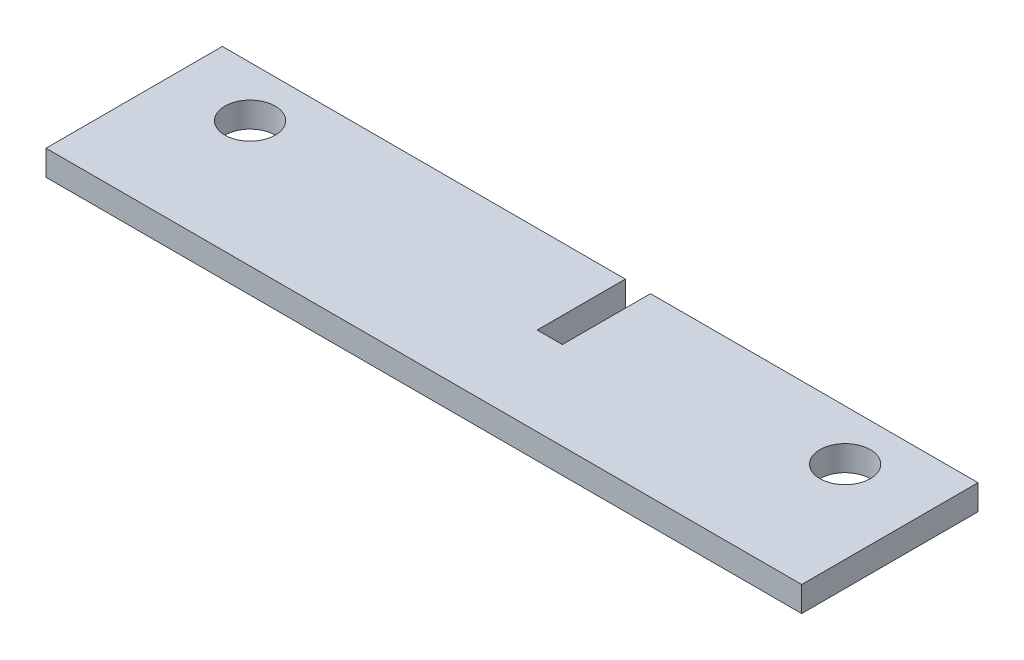
ISO-10303-21;
HEADER;
FILE_DESCRIPTION(('STEP AP214'),'2;1');
FILE_NAME('part.step','',(''),(''),'','','');
FILE_SCHEMA(('AUTOMOTIVE_DESIGN { 1 0 10303 214 1 1 1 1 }'));
ENDSEC;
DATA;
#1=APPLICATION_CONTEXT('core data for automotive mechanical design processes');
#2=APPLICATION_PROTOCOL_DEFINITION('international standard','automotive_design',2000,#1);
#3=PRODUCT_CONTEXT('',#1,'mechanical');
#4=PRODUCT('Part','Part','',(#3));
#5=PRODUCT_RELATED_PRODUCT_CATEGORY('part','',(#4));
#6=PRODUCT_DEFINITION_FORMATION('','',#4);
#7=PRODUCT_DEFINITION_CONTEXT('part definition',#1,'design');
#8=PRODUCT_DEFINITION('design','',#6,#7);
#9=PRODUCT_DEFINITION_SHAPE('','',#8);
#10=(LENGTH_UNIT() NAMED_UNIT(*) SI_UNIT(.MILLI.,.METRE.));
#11=(NAMED_UNIT(*) PLANE_ANGLE_UNIT() SI_UNIT($,.RADIAN.));
#12=(NAMED_UNIT(*) SI_UNIT($,.STERADIAN.) SOLID_ANGLE_UNIT());
#13=UNCERTAINTY_MEASURE_WITH_UNIT(LENGTH_MEASURE(1.E-05),#10,'distance_accuracy_value','');
#14=(GEOMETRIC_REPRESENTATION_CONTEXT(3) GLOBAL_UNCERTAINTY_ASSIGNED_CONTEXT((#13)) GLOBAL_UNIT_ASSIGNED_CONTEXT((#10,
#11,#12)) REPRESENTATION_CONTEXT('',''));
#15=CARTESIAN_POINT('',(0.,0.,0.));
#16=DIRECTION('',(0.,0.,1.));
#17=DIRECTION('',(1.,0.,0.));
#18=AXIS2_PLACEMENT_3D('',#15,#16,#17);
#19=CARTESIAN_POINT('',(0.,0.,249.6));
#20=DIRECTION('',(0.,0.,1.));
#21=DIRECTION('',(1.,0.,0.));
#22=AXIS2_PLACEMENT_3D('',#19,#20,#21);
#23=PLANE('',#22);
#24=DIRECTION('',(-1.,0.,0.));
#25=VECTOR('',#24,1.);
#26=CARTESIAN_POINT('',(2260.6,65.,249.6));
#27=LINE('',#26,#25);
#28=CARTESIAN_POINT('',(2463.8,65.,249.6));
#29=VERTEX_POINT('',#28);
#30=CARTESIAN_POINT('',(2260.6,65.,249.6));
#31=VERTEX_POINT('',#30);
#32=EDGE_CURVE('E159',#29,#31,#27,.T.);
#33=ORIENTED_EDGE('',*,*,#32,.F.);
#34=DIRECTION('',(0.,1.,0.));
#35=VECTOR('',#34,1.);
#36=CARTESIAN_POINT('',(2463.8,52.3,249.6));
#37=LINE('',#36,#35);
#38=CARTESIAN_POINT('',(2463.8,52.3,249.6));
#39=VERTEX_POINT('',#38);
#40=EDGE_CURVE('E140',#39,#29,#37,.T.);
#41=ORIENTED_EDGE('',*,*,#40,.F.);
#42=DIRECTION('',(1.,0.,0.));
#43=VECTOR('',#42,1.);
#44=CARTESIAN_POINT('',(2260.6,52.3,249.6));
#45=LINE('',#44,#43);
#46=CARTESIAN_POINT('',(2260.6,52.3,249.6));
#47=VERTEX_POINT('',#46);
#48=EDGE_CURVE('E134',#47,#39,#45,.T.);
#49=ORIENTED_EDGE('',*,*,#48,.F.);
#50=DIRECTION('',(0.,-1.,0.));
#51=VECTOR('',#50,1.);
#52=CARTESIAN_POINT('',(2260.6,65.,249.6));
#53=LINE('',#52,#51);
#54=EDGE_CURVE('E113',#31,#47,#53,.T.);
#55=ORIENTED_EDGE('',*,*,#54,.F.);
#56=EDGE_LOOP('',(#33,#41,#49,#55));
#57=FACE_BOUND('',#56,.T.);
#58=ADVANCED_FACE('F37',(#57),#23,.F.);
#59=CARTESIAN_POINT('',(2260.6,65.,249.6));
#60=DIRECTION('',(-1.,0.,0.));
#61=DIRECTION('',(0.,0.,1.));
#62=AXIS2_PLACEMENT_3D('',#59,#60,#61);
#63=PLANE('',#62);
#64=DIRECTION('',(0.,0.,1.));
#65=VECTOR('',#64,1.);
#66=CARTESIAN_POINT('',(2260.6,52.3,249.6));
#67=LINE('',#66,#65);
#68=CARTESIAN_POINT('',(2260.6,52.3,338.5));
#69=VERTEX_POINT('',#68);
#70=EDGE_CURVE('E106',#47,#69,#67,.T.);
#71=ORIENTED_EDGE('',*,*,#70,.T.);
#72=DIRECTION('',(0.,-1.,0.));
#73=VECTOR('',#72,1.);
#74=CARTESIAN_POINT('',(2260.6,65.,338.5));
#75=LINE('',#74,#73);
#76=CARTESIAN_POINT('',(2260.6,65.,338.5));
#77=VERTEX_POINT('',#76);
#78=EDGE_CURVE('E111',#77,#69,#75,.T.);
#79=ORIENTED_EDGE('',*,*,#78,.F.);
#80=DIRECTION('',(0.,0.,1.));
#81=VECTOR('',#80,1.);
#82=CARTESIAN_POINT('',(2260.6,65.,249.6));
#83=LINE('',#82,#81);
#84=EDGE_CURVE('E170',#31,#77,#83,.T.);
#85=ORIENTED_EDGE('',*,*,#84,.F.);
#86=ORIENTED_EDGE('',*,*,#54,.T.);
#87=EDGE_LOOP('',(#71,#79,#85,#86));
#88=FACE_BOUND('',#87,.T.);
#89=ADVANCED_FACE('F108',(#88),#63,.T.);
#90=CARTESIAN_POINT('',(2260.6,65.,249.6));
#91=DIRECTION('',(0.,1.,0.));
#92=DIRECTION('',(0.,0.,1.));
#93=AXIS2_PLACEMENT_3D('',#90,#91,#92);
#94=PLANE('',#93);
#95=CARTESIAN_POINT('',(2599.99999999996,65.,275.));
#96=DIRECTION('',(0.,1.,0.));
#97=DIRECTION('',(0.,0.,1.));
#98=AXIS2_PLACEMENT_3D('',#95,#96,#97);
#99=CIRCLE('',#98,12.6999999999999);
#100=CARTESIAN_POINT('',(2599.99999999996,64.9999999999999,262.3));
#101=VERTEX_POINT('',#100);
#102=EDGE_CURVE('E154',#101,#101,#99,.F.);
#103=ORIENTED_EDGE('',*,*,#102,.T.);
#104=EDGE_LOOP('',(#103));
#105=FACE_BOUND('',#104,.T.);
#106=CARTESIAN_POINT('',(2299.99999999996,65.,275.));
#107=DIRECTION('',(0.,1.,0.));
#108=DIRECTION('',(0.,0.,1.));
#109=AXIS2_PLACEMENT_3D('',#106,#107,#108);
#110=CIRCLE('',#109,12.6999999999999);
#111=CARTESIAN_POINT('',(2299.99999999996,65.,262.3));
#112=VERTEX_POINT('',#111);
#113=EDGE_CURVE('E41',#112,#112,#110,.F.);
#114=ORIENTED_EDGE('',*,*,#113,.T.);
#115=EDGE_LOOP('',(#114));
#116=FACE_BOUND('',#115,.T.);
#117=DIRECTION('',(0.,0.,1.));
#118=VECTOR('',#117,1.);
#119=CARTESIAN_POINT('',(2463.8,65.,249.6));
#120=LINE('',#119,#118);
#121=CARTESIAN_POINT('',(2463.8,65.,294.05));
#122=VERTEX_POINT('',#121);
#123=EDGE_CURVE('E142',#29,#122,#120,.T.);
#124=ORIENTED_EDGE('',*,*,#123,.F.);
#125=ORIENTED_EDGE('',*,*,#32,.T.);
#126=ORIENTED_EDGE('',*,*,#84,.T.);
#127=DIRECTION('',(-1.,0.,0.));
#128=VECTOR('',#127,1.);
#129=CARTESIAN_POINT('',(2260.6,65.,338.5));
#130=LINE('',#129,#128);
#131=CARTESIAN_POINT('',(2641.6,65.,338.5));
#132=VERTEX_POINT('',#131);
#133=EDGE_CURVE('E132',#132,#77,#130,.T.);
#134=ORIENTED_EDGE('',*,*,#133,.F.);
#135=DIRECTION('',(0.,0.,1.));
#136=VECTOR('',#135,1.);
#137=CARTESIAN_POINT('',(2641.6,65.,249.6));
#138=LINE('',#137,#136);
#139=CARTESIAN_POINT('',(2641.6,65.,249.6));
#140=VERTEX_POINT('',#139);
#141=EDGE_CURVE('E168',#140,#132,#138,.T.);
#142=ORIENTED_EDGE('',*,*,#141,.F.);
#143=CARTESIAN_POINT('',(2476.5,65.,249.6));
#144=VERTEX_POINT('',#143);
#145=EDGE_CURVE('E172',#140,#144,#27,.T.);
#146=ORIENTED_EDGE('',*,*,#145,.T.);
#147=DIRECTION('',(0.,0.,-1.));
#148=VECTOR('',#147,1.);
#149=CARTESIAN_POINT('',(2476.5,65.,249.6));
#150=LINE('',#149,#148);
#151=CARTESIAN_POINT('',(2476.5,65.,294.05));
#152=VERTEX_POINT('',#151);
#153=EDGE_CURVE('E77',#152,#144,#150,.T.);
#154=ORIENTED_EDGE('',*,*,#153,.F.);
#155=DIRECTION('',(1.,0.,0.));
#156=VECTOR('',#155,1.);
#157=CARTESIAN_POINT('',(2463.8,65.,294.05));
#158=LINE('',#157,#156);
#159=EDGE_CURVE('E47',#122,#152,#158,.T.);
#160=ORIENTED_EDGE('',*,*,#159,.F.);
#161=EDGE_LOOP('',(#124,#125,#126,#134,#142,#146,#154,#160));
#162=FACE_BOUND('',#161,.T.);
#163=ADVANCED_FACE('F39',(#105,#116,#162),#94,.T.);
#164=CARTESIAN_POINT('',(2641.6,65.,249.6));
#165=DIRECTION('',(1.,0.,0.));
#166=DIRECTION('',(0.,0.,-1.));
#167=AXIS2_PLACEMENT_3D('',#164,#165,#166);
#168=PLANE('',#167);
#169=ORIENTED_EDGE('',*,*,#141,.T.);
#170=DIRECTION('',(0.,1.,0.));
#171=VECTOR('',#170,1.);
#172=CARTESIAN_POINT('',(2641.6,65.,338.5));
#173=LINE('',#172,#171);
#174=CARTESIAN_POINT('',(2641.6,52.3,338.5));
#175=VERTEX_POINT('',#174);
#176=EDGE_CURVE('E127',#175,#132,#173,.T.);
#177=ORIENTED_EDGE('',*,*,#176,.F.);
#178=DIRECTION('',(0.,0.,1.));
#179=VECTOR('',#178,1.);
#180=CARTESIAN_POINT('',(2641.6,52.3,249.6));
#181=LINE('',#180,#179);
#182=CARTESIAN_POINT('',(2641.6,52.3,249.6));
#183=VERTEX_POINT('',#182);
#184=EDGE_CURVE('E123',#183,#175,#181,.T.);
#185=ORIENTED_EDGE('',*,*,#184,.F.);
#186=DIRECTION('',(0.,1.,0.));
#187=VECTOR('',#186,1.);
#188=CARTESIAN_POINT('',(2641.6,65.,249.6));
#189=LINE('',#188,#187);
#190=EDGE_CURVE('E177',#183,#140,#189,.T.);
#191=ORIENTED_EDGE('',*,*,#190,.T.);
#192=EDGE_LOOP('',(#169,#177,#185,#191));
#193=FACE_BOUND('',#192,.T.);
#194=ADVANCED_FACE('F183',(#193),#168,.T.);
#195=CARTESIAN_POINT('',(2260.6,52.3,249.6));
#196=DIRECTION('',(0.,-1.,0.));
#197=DIRECTION('',(0.,0.,-1.));
#198=AXIS2_PLACEMENT_3D('',#195,#196,#197);
#199=PLANE('',#198);
#200=CARTESIAN_POINT('',(2599.99999999996,52.3,275.));
#201=DIRECTION('',(0.,-1.,0.));
#202=DIRECTION('',(0.,0.,-1.));
#203=AXIS2_PLACEMENT_3D('',#200,#201,#202);
#204=CIRCLE('',#203,12.6999999999999);
#205=CARTESIAN_POINT('',(2599.99999999996,52.3,262.3));
#206=VERTEX_POINT('',#205);
#207=EDGE_CURVE('E178',#206,#206,#204,.F.);
#208=ORIENTED_EDGE('',*,*,#207,.T.);
#209=EDGE_LOOP('',(#208));
#210=FACE_BOUND('',#209,.T.);
#211=CARTESIAN_POINT('',(2299.99999999996,52.3,275.));
#212=DIRECTION('',(0.,-1.,0.));
#213=DIRECTION('',(0.,0.,-1.));
#214=AXIS2_PLACEMENT_3D('',#211,#212,#213);
#215=CIRCLE('',#214,12.6999999999999);
#216=CARTESIAN_POINT('',(2299.99999999996,52.3,262.3));
#217=VERTEX_POINT('',#216);
#218=EDGE_CURVE('E153',#217,#217,#215,.F.);
#219=ORIENTED_EDGE('',*,*,#218,.T.);
#220=EDGE_LOOP('',(#219));
#221=FACE_BOUND('',#220,.T.);
#222=DIRECTION('',(0.,0.,1.));
#223=VECTOR('',#222,1.);
#224=CARTESIAN_POINT('',(2463.8,52.3,249.6));
#225=LINE('',#224,#223);
#226=CARTESIAN_POINT('',(2463.8,52.3,294.05));
#227=VERTEX_POINT('',#226);
#228=EDGE_CURVE('E152',#39,#227,#225,.T.);
#229=ORIENTED_EDGE('',*,*,#228,.T.);
#230=DIRECTION('',(1.,0.,0.));
#231=VECTOR('',#230,1.);
#232=CARTESIAN_POINT('',(2463.8,52.3,294.05));
#233=LINE('',#232,#231);
#234=CARTESIAN_POINT('',(2476.5,52.3,294.05));
#235=VERTEX_POINT('',#234);
#236=EDGE_CURVE('E149',#227,#235,#233,.T.);
#237=ORIENTED_EDGE('',*,*,#236,.T.);
#238=DIRECTION('',(0.,0.,-1.));
#239=VECTOR('',#238,1.);
#240=CARTESIAN_POINT('',(2476.5,52.3,249.6));
#241=LINE('',#240,#239);
#242=CARTESIAN_POINT('',(2476.5,52.3,249.6));
#243=VERTEX_POINT('',#242);
#244=EDGE_CURVE('E146',#235,#243,#241,.T.);
#245=ORIENTED_EDGE('',*,*,#244,.T.);
#246=EDGE_CURVE('E148',#243,#183,#45,.T.);
#247=ORIENTED_EDGE('',*,*,#246,.T.);
#248=ORIENTED_EDGE('',*,*,#184,.T.);
#249=DIRECTION('',(1.,0.,0.));
#250=VECTOR('',#249,1.);
#251=CARTESIAN_POINT('',(2260.6,52.3,338.5));
#252=LINE('',#251,#250);
#253=EDGE_CURVE('E119',#69,#175,#252,.T.);
#254=ORIENTED_EDGE('',*,*,#253,.F.);
#255=ORIENTED_EDGE('',*,*,#70,.F.);
#256=ORIENTED_EDGE('',*,*,#48,.T.);
#257=EDGE_LOOP('',(#229,#237,#245,#247,#248,#254,#255,#256));
#258=FACE_BOUND('',#257,.T.);
#259=ADVANCED_FACE('F121',(#210,#221,#258),#199,.T.);
#260=ORIENTED_EDGE('',*,*,#246,.F.);
#261=DIRECTION('',(0.,1.,0.));
#262=VECTOR('',#261,1.);
#263=CARTESIAN_POINT('',(2476.5,52.3,249.6));
#264=LINE('',#263,#262);
#265=EDGE_CURVE('E72',#243,#144,#264,.T.);
#266=ORIENTED_EDGE('',*,*,#265,.T.);
#267=ORIENTED_EDGE('',*,*,#145,.F.);
#268=ORIENTED_EDGE('',*,*,#190,.F.);
#269=EDGE_LOOP('',(#260,#266,#267,#268));
#270=FACE_BOUND('',#269,.T.);
#271=ADVANCED_FACE('F190',(#270),#23,.F.);
#272=CARTESIAN_POINT('',(0.,0.,338.5));
#273=DIRECTION('',(0.,0.,1.));
#274=DIRECTION('',(1.,0.,0.));
#275=AXIS2_PLACEMENT_3D('',#272,#273,#274);
#276=PLANE('',#275);
#277=ORIENTED_EDGE('',*,*,#78,.T.);
#278=ORIENTED_EDGE('',*,*,#253,.T.);
#279=ORIENTED_EDGE('',*,*,#176,.T.);
#280=ORIENTED_EDGE('',*,*,#133,.T.);
#281=EDGE_LOOP('',(#277,#278,#279,#280));
#282=FACE_BOUND('',#281,.T.);
#283=ADVANCED_FACE('F130',(#282),#276,.T.);
#284=CARTESIAN_POINT('',(2463.8,52.3,249.6));
#285=DIRECTION('',(-1.,0.,0.));
#286=DIRECTION('',(0.,0.,1.));
#287=AXIS2_PLACEMENT_3D('',#284,#285,#286);
#288=PLANE('',#287);
#289=ORIENTED_EDGE('',*,*,#123,.T.);
#290=DIRECTION('',(0.,1.,0.));
#291=VECTOR('',#290,1.);
#292=CARTESIAN_POINT('',(2463.8,52.3,294.05));
#293=LINE('',#292,#291);
#294=EDGE_CURVE('E11',#227,#122,#293,.T.);
#295=ORIENTED_EDGE('',*,*,#294,.F.);
#296=ORIENTED_EDGE('',*,*,#228,.F.);
#297=ORIENTED_EDGE('',*,*,#40,.T.);
#298=EDGE_LOOP('',(#289,#295,#296,#297));
#299=FACE_BOUND('',#298,.T.);
#300=ADVANCED_FACE('F205',(#299),#288,.F.);
#301=CARTESIAN_POINT('',(2476.5,52.3,249.6));
#302=DIRECTION('',(1.,0.,0.));
#303=DIRECTION('',(0.,0.,-1.));
#304=AXIS2_PLACEMENT_3D('',#301,#302,#303);
#305=PLANE('',#304);
#306=ORIENTED_EDGE('',*,*,#153,.T.);
#307=ORIENTED_EDGE('',*,*,#265,.F.);
#308=ORIENTED_EDGE('',*,*,#244,.F.);
#309=DIRECTION('',(0.,1.,0.));
#310=VECTOR('',#309,1.);
#311=CARTESIAN_POINT('',(2476.5,52.3,294.05));
#312=LINE('',#311,#310);
#313=EDGE_CURVE('E138',#235,#152,#312,.T.);
#314=ORIENTED_EDGE('',*,*,#313,.T.);
#315=EDGE_LOOP('',(#306,#307,#308,#314));
#316=FACE_BOUND('',#315,.T.);
#317=ADVANCED_FACE('F211',(#316),#305,.F.);
#318=CARTESIAN_POINT('',(2463.8,52.3,294.05));
#319=DIRECTION('',(0.,0.,1.));
#320=DIRECTION('',(1.,0.,0.));
#321=AXIS2_PLACEMENT_3D('',#318,#319,#320);
#322=PLANE('',#321);
#323=ORIENTED_EDGE('',*,*,#159,.T.);
#324=ORIENTED_EDGE('',*,*,#313,.F.);
#325=ORIENTED_EDGE('',*,*,#236,.F.);
#326=ORIENTED_EDGE('',*,*,#294,.T.);
#327=EDGE_LOOP('',(#323,#324,#325,#326));
#328=FACE_BOUND('',#327,.T.);
#329=ADVANCED_FACE('F210',(#328),#322,.F.);
#330=CARTESIAN_POINT('',(2299.99999999996,181.249999999996,275.));
#331=DIRECTION('',(0.,-1.,0.));
#332=DIRECTION('',(0.,0.,-1.));
#333=AXIS2_PLACEMENT_3D('',#330,#331,#332);
#334=CYLINDRICAL_SURFACE('',#333,12.6999999999999);
#335=CARTESIAN_POINT('',(2299.99999999996,65.,262.3));
#336=CARTESIAN_POINT('',(2299.99999999996,64.8677083333333,262.3));
#337=CARTESIAN_POINT('',(2299.99999999996,64.7354166666666,262.3));
#338=CARTESIAN_POINT('',(2299.99999999996,64.4708333333333,262.3));
#339=CARTESIAN_POINT('',(2299.99999999996,64.3385416666666,262.3));
#340=CARTESIAN_POINT('',(2299.99999999996,64.0739583333333,262.3));
#341=CARTESIAN_POINT('',(2299.99999999996,63.9416666666666,262.3));
#342=CARTESIAN_POINT('',(2299.99999999996,63.6770833333333,262.3));
#343=CARTESIAN_POINT('',(2299.99999999996,63.5447916666666,262.3));
#344=CARTESIAN_POINT('',(2299.99999999996,63.2802083333333,262.3));
#345=CARTESIAN_POINT('',(2299.99999999996,63.1479166666666,262.3));
#346=CARTESIAN_POINT('',(2299.99999999996,62.8833333333333,262.3));
#347=CARTESIAN_POINT('',(2299.99999999996,62.7510416666666,262.3));
#348=CARTESIAN_POINT('',(2299.99999999996,62.4864583333333,262.3));
#349=CARTESIAN_POINT('',(2299.99999999996,62.3541666666666,262.3));
#350=CARTESIAN_POINT('',(2299.99999999996,62.0895833333333,262.3));
#351=CARTESIAN_POINT('',(2299.99999999996,61.9572916666666,262.3));
#352=CARTESIAN_POINT('',(2299.99999999996,61.6927083333333,262.3));
#353=CARTESIAN_POINT('',(2299.99999999996,61.5604166666666,262.3));
#354=CARTESIAN_POINT('',(2299.99999999996,61.2958333333333,262.3));
#355=CARTESIAN_POINT('',(2299.99999999996,61.1635416666666,262.3));
#356=CARTESIAN_POINT('',(2299.99999999996,60.8989583333333,262.3));
#357=CARTESIAN_POINT('',(2299.99999999996,60.7666666666666,262.3));
#358=CARTESIAN_POINT('',(2299.99999999996,60.5020833333333,262.3));
#359=CARTESIAN_POINT('',(2299.99999999996,60.3697916666666,262.3));
#360=CARTESIAN_POINT('',(2299.99999999996,60.1052083333333,262.3));
#361=CARTESIAN_POINT('',(2299.99999999996,59.9729166666666,262.3));
#362=CARTESIAN_POINT('',(2299.99999999996,59.7083333333333,262.3));
#363=CARTESIAN_POINT('',(2299.99999999996,59.5760416666666,262.3));
#364=CARTESIAN_POINT('',(2299.99999999996,59.3114583333333,262.3));
#365=CARTESIAN_POINT('',(2299.99999999996,59.1791666666666,262.3));
#366=CARTESIAN_POINT('',(2299.99999999996,58.9145833333333,262.3));
#367=CARTESIAN_POINT('',(2299.99999999996,58.7822916666666,262.3));
#368=CARTESIAN_POINT('',(2299.99999999996,58.5177083333333,262.3));
#369=CARTESIAN_POINT('',(2299.99999999996,58.3854166666666,262.3));
#370=CARTESIAN_POINT('',(2299.99999999996,58.1208333333333,262.3));
#371=CARTESIAN_POINT('',(2299.99999999996,57.9885416666666,262.3));
#372=CARTESIAN_POINT('',(2299.99999999996,57.7239583333333,262.3));
#373=CARTESIAN_POINT('',(2299.99999999996,57.5916666666666,262.3));
#374=CARTESIAN_POINT('',(2299.99999999996,57.3270833333333,262.3));
#375=CARTESIAN_POINT('',(2299.99999999996,57.1947916666666,262.3));
#376=CARTESIAN_POINT('',(2299.99999999996,56.9302083333333,262.3));
#377=CARTESIAN_POINT('',(2299.99999999996,56.7979166666666,262.3));
#378=CARTESIAN_POINT('',(2299.99999999996,56.5333333333333,262.3));
#379=CARTESIAN_POINT('',(2299.99999999996,56.4010416666666,262.3));
#380=CARTESIAN_POINT('',(2299.99999999996,56.1364583333333,262.3));
#381=CARTESIAN_POINT('',(2299.99999999996,56.0041666666666,262.3));
#382=CARTESIAN_POINT('',(2299.99999999996,55.7395833333333,262.3));
#383=CARTESIAN_POINT('',(2299.99999999996,55.6072916666666,262.3));
#384=CARTESIAN_POINT('',(2299.99999999996,55.3427083333333,262.3));
#385=CARTESIAN_POINT('',(2299.99999999996,55.2104166666666,262.3));
#386=CARTESIAN_POINT('',(2299.99999999996,54.9458333333333,262.3));
#387=CARTESIAN_POINT('',(2299.99999999996,54.8135416666666,262.3));
#388=CARTESIAN_POINT('',(2299.99999999996,54.5489583333333,262.3));
#389=CARTESIAN_POINT('',(2299.99999999996,54.4166666666666,262.3));
#390=CARTESIAN_POINT('',(2299.99999999996,54.1520833333333,262.3));
#391=CARTESIAN_POINT('',(2299.99999999996,54.0197916666666,262.3));
#392=CARTESIAN_POINT('',(2299.99999999996,53.7552083333333,262.3));
#393=CARTESIAN_POINT('',(2299.99999999996,53.6229166666666,262.3));
#394=CARTESIAN_POINT('',(2299.99999999996,53.3583333333333,262.3));
#395=CARTESIAN_POINT('',(2299.99999999996,53.2260416666666,262.3));
#396=CARTESIAN_POINT('',(2299.99999999996,52.9614583333333,262.3));
#397=CARTESIAN_POINT('',(2299.99999999996,52.8291666666666,262.3));
#398=CARTESIAN_POINT('',(2299.99999999996,52.5645833333333,262.3));
#399=CARTESIAN_POINT('',(2299.99999999996,52.4322916666666,262.3));
#400=CARTESIAN_POINT('',(2299.99999999996,52.3,262.3));
#401=B_SPLINE_CURVE_WITH_KNOTS('',3,(#335,#336,#337,#338,#339,#340,#341,#342,#343,#344,#345,
#346,#347,#348,#349,#350,#351,#352,#353,#354,#355,#356,#357,#358,#359,#360,#361,#362,#363,#364,
#365,#366,#367,#368,#369,#370,#371,#372,#373,#374,#375,#376,#377,#378,#379,#380,#381,#382,#383,
#384,#385,#386,#387,#388,#389,#390,#391,#392,#393,#394,#395,#396,#397,#398,#399,#400),
.UNSPECIFIED.,.F.,.F.,(4,2,2,2,2,2,2,2,2,2,2,2,2,2,2,2,2,2,2,2,2,2,2,2,2,2,2,2,2,2,2,2,4),(0.,
0.396875000000005,0.793749999999996,1.190625,1.58750000000001,1.984375,2.38125,2.77812500000001,
3.17500000000001,3.571875,3.96875000000001,4.36562500000001,4.7625,5.15937500000001,
5.55625000000001,5.953125,6.35000000000001,6.74687500000001,7.14375,7.54062500000001,
7.93750000000001,8.334375,8.73125000000001,9.12812500000001,9.52500000000001,9.92187500000002,
10.31875,10.715625,11.1125,11.509375,11.90625,12.303125,12.7),.UNSPECIFIED.);
#402=EDGE_CURVE('BSEAM218',#112,#217,#401,.T.);
#403=ORIENTED_EDGE('',*,*,#113,.F.);
#404=ORIENTED_EDGE('',*,*,#218,.F.);
#405=ORIENTED_EDGE('',*,*,#402,.T.);
#406=ORIENTED_EDGE('',*,*,#402,.F.);
#407=EDGE_LOOP('',(#403,#405,#404,#406));
#408=FACE_BOUND('',#407,.T.);
#409=ADVANCED_FACE('F218',(#408),#334,.F.);
#410=CARTESIAN_POINT('',(2599.99999999996,289.999999999996,275.));
#411=DIRECTION('',(0.,-1.,0.));
#412=DIRECTION('',(0.,0.,-1.));
#413=AXIS2_PLACEMENT_3D('',#410,#411,#412);
#414=CYLINDRICAL_SURFACE('',#413,12.6999999999999);
#415=CARTESIAN_POINT('',(2599.99999999996,64.9999999999999,262.3));
#416=CARTESIAN_POINT('',(2599.99999999996,64.8677083333333,262.3));
#417=CARTESIAN_POINT('',(2599.99999999996,64.7354166666666,262.3));
#418=CARTESIAN_POINT('',(2599.99999999996,64.4708333333333,262.3));
#419=CARTESIAN_POINT('',(2599.99999999996,64.3385416666666,262.3));
#420=CARTESIAN_POINT('',(2599.99999999996,64.0739583333333,262.3));
#421=CARTESIAN_POINT('',(2599.99999999996,63.9416666666666,262.3));
#422=CARTESIAN_POINT('',(2599.99999999996,63.6770833333333,262.3));
#423=CARTESIAN_POINT('',(2599.99999999996,63.5447916666666,262.3));
#424=CARTESIAN_POINT('',(2599.99999999996,63.2802083333333,262.3));
#425=CARTESIAN_POINT('',(2599.99999999996,63.1479166666666,262.3));
#426=CARTESIAN_POINT('',(2599.99999999996,62.8833333333333,262.3));
#427=CARTESIAN_POINT('',(2599.99999999996,62.7510416666666,262.3));
#428=CARTESIAN_POINT('',(2599.99999999996,62.4864583333333,262.3));
#429=CARTESIAN_POINT('',(2599.99999999996,62.3541666666666,262.3));
#430=CARTESIAN_POINT('',(2599.99999999996,62.0895833333333,262.3));
#431=CARTESIAN_POINT('',(2599.99999999996,61.9572916666666,262.3));
#432=CARTESIAN_POINT('',(2599.99999999996,61.6927083333333,262.3));
#433=CARTESIAN_POINT('',(2599.99999999996,61.5604166666666,262.3));
#434=CARTESIAN_POINT('',(2599.99999999996,61.2958333333333,262.3));
#435=CARTESIAN_POINT('',(2599.99999999996,61.1635416666666,262.3));
#436=CARTESIAN_POINT('',(2599.99999999996,60.8989583333333,262.3));
#437=CARTESIAN_POINT('',(2599.99999999996,60.7666666666666,262.3));
#438=CARTESIAN_POINT('',(2599.99999999996,60.5020833333333,262.3));
#439=CARTESIAN_POINT('',(2599.99999999996,60.3697916666666,262.3));
#440=CARTESIAN_POINT('',(2599.99999999996,60.1052083333333,262.3));
#441=CARTESIAN_POINT('',(2599.99999999996,59.9729166666666,262.3));
#442=CARTESIAN_POINT('',(2599.99999999996,59.7083333333333,262.3));
#443=CARTESIAN_POINT('',(2599.99999999996,59.5760416666666,262.3));
#444=CARTESIAN_POINT('',(2599.99999999996,59.3114583333333,262.3));
#445=CARTESIAN_POINT('',(2599.99999999996,59.1791666666666,262.3));
#446=CARTESIAN_POINT('',(2599.99999999996,58.9145833333333,262.3));
#447=CARTESIAN_POINT('',(2599.99999999996,58.7822916666666,262.3));
#448=CARTESIAN_POINT('',(2599.99999999996,58.5177083333333,262.3));
#449=CARTESIAN_POINT('',(2599.99999999996,58.3854166666666,262.3));
#450=CARTESIAN_POINT('',(2599.99999999996,58.1208333333333,262.3));
#451=CARTESIAN_POINT('',(2599.99999999996,57.9885416666666,262.3));
#452=CARTESIAN_POINT('',(2599.99999999996,57.7239583333333,262.3));
#453=CARTESIAN_POINT('',(2599.99999999996,57.5916666666666,262.3));
#454=CARTESIAN_POINT('',(2599.99999999996,57.3270833333333,262.3));
#455=CARTESIAN_POINT('',(2599.99999999996,57.1947916666666,262.3));
#456=CARTESIAN_POINT('',(2599.99999999996,56.9302083333333,262.3));
#457=CARTESIAN_POINT('',(2599.99999999996,56.7979166666666,262.3));
#458=CARTESIAN_POINT('',(2599.99999999996,56.5333333333333,262.3));
#459=CARTESIAN_POINT('',(2599.99999999996,56.4010416666666,262.3));
#460=CARTESIAN_POINT('',(2599.99999999996,56.1364583333333,262.3));
#461=CARTESIAN_POINT('',(2599.99999999996,56.0041666666666,262.3));
#462=CARTESIAN_POINT('',(2599.99999999996,55.7395833333333,262.3));
#463=CARTESIAN_POINT('',(2599.99999999996,55.6072916666666,262.3));
#464=CARTESIAN_POINT('',(2599.99999999996,55.3427083333333,262.3));
#465=CARTESIAN_POINT('',(2599.99999999996,55.2104166666666,262.3));
#466=CARTESIAN_POINT('',(2599.99999999996,54.9458333333333,262.3));
#467=CARTESIAN_POINT('',(2599.99999999996,54.8135416666666,262.3));
#468=CARTESIAN_POINT('',(2599.99999999996,54.5489583333333,262.3));
#469=CARTESIAN_POINT('',(2599.99999999996,54.4166666666666,262.3));
#470=CARTESIAN_POINT('',(2599.99999999996,54.1520833333333,262.3));
#471=CARTESIAN_POINT('',(2599.99999999996,54.0197916666666,262.3));
#472=CARTESIAN_POINT('',(2599.99999999996,53.7552083333333,262.3));
#473=CARTESIAN_POINT('',(2599.99999999996,53.6229166666666,262.3));
#474=CARTESIAN_POINT('',(2599.99999999996,53.3583333333333,262.3));
#475=CARTESIAN_POINT('',(2599.99999999996,53.2260416666666,262.3));
#476=CARTESIAN_POINT('',(2599.99999999996,52.9614583333333,262.3));
#477=CARTESIAN_POINT('',(2599.99999999996,52.8291666666666,262.3));
#478=CARTESIAN_POINT('',(2599.99999999996,52.5645833333333,262.3));
#479=CARTESIAN_POINT('',(2599.99999999996,52.4322916666666,262.3));
#480=CARTESIAN_POINT('',(2599.99999999996,52.3,262.3));
#481=B_SPLINE_CURVE_WITH_KNOTS('',3,(#415,#416,#417,#418,#419,#420,#421,#422,#423,#424,#425,
#426,#427,#428,#429,#430,#431,#432,#433,#434,#435,#436,#437,#438,#439,#440,#441,#442,#443,#444,
#445,#446,#447,#448,#449,#450,#451,#452,#453,#454,#455,#456,#457,#458,#459,#460,#461,#462,#463,
#464,#465,#466,#467,#468,#469,#470,#471,#472,#473,#474,#475,#476,#477,#478,#479,#480),
.UNSPECIFIED.,.F.,.F.,(4,2,2,2,2,2,2,2,2,2,2,2,2,2,2,2,2,2,2,2,2,2,2,2,2,2,2,2,2,2,2,2,4),(0.,
0.396874999999991,0.79375000000001,1.190625,1.58749999999999,1.98437500000001,2.38125,
2.77812499999999,3.17499999999998,3.571875,3.96874999999999,4.36562499999998,4.7625,
5.15937499999999,5.55624999999998,5.953125,6.34999999999999,6.74687499999999,7.14375,7.540625,
7.93749999999999,8.334375,8.73125,9.12812499999999,9.52500000000001,9.921875,10.31875,10.715625,
11.1125,11.509375,11.90625,12.303125,12.7),.UNSPECIFIED.);
#482=EDGE_CURVE('BSEAM222',#101,#206,#481,.T.);
#483=ORIENTED_EDGE('',*,*,#102,.F.);
#484=ORIENTED_EDGE('',*,*,#207,.F.);
#485=ORIENTED_EDGE('',*,*,#482,.T.);
#486=ORIENTED_EDGE('',*,*,#482,.F.);
#487=EDGE_LOOP('',(#483,#485,#484,#486));
#488=FACE_BOUND('',#487,.T.);
#489=ADVANCED_FACE('F222',(#488),#414,.F.);
#490=CLOSED_SHELL('',(#58,#89,#163,#194,#259,#271,#283,#300,#317,#329,#409,#489));
#491=MANIFOLD_SOLID_BREP('B2',#490);
#492=ADVANCED_BREP_SHAPE_REPRESENTATION('',(#18,#491),#14);
#493=SHAPE_DEFINITION_REPRESENTATION(#9,#492);
ENDSEC;
END-ISO-10303-21;
